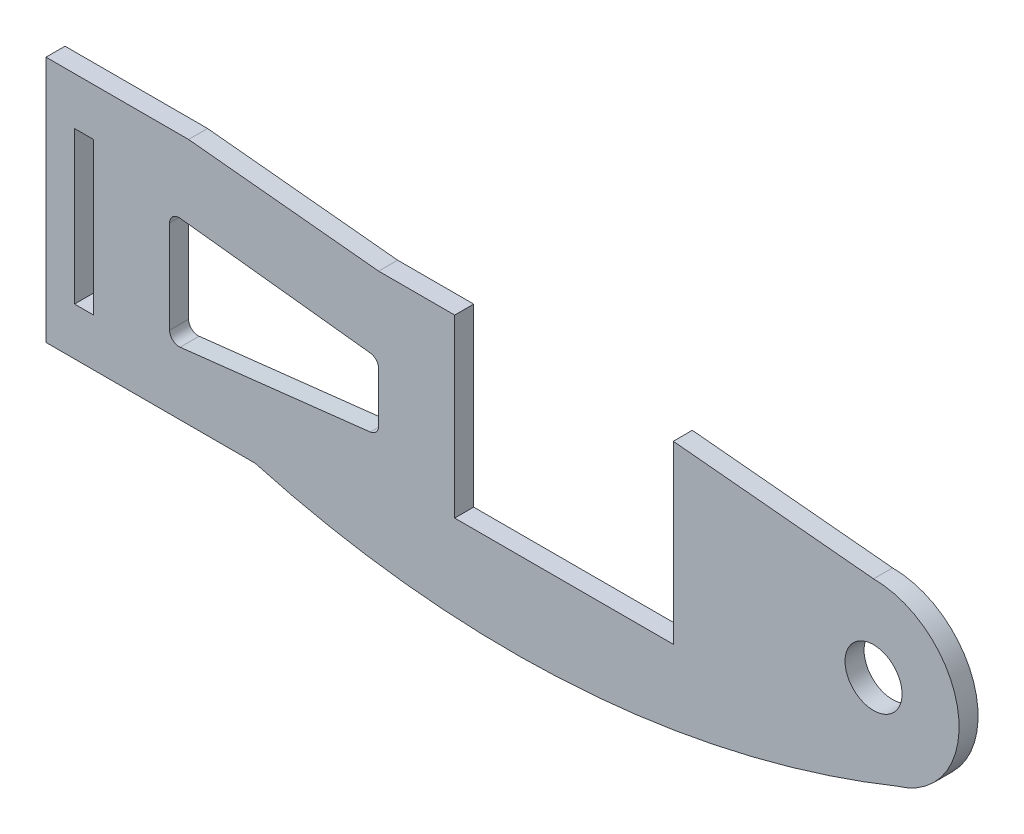
ISO-10303-21;
HEADER;
FILE_DESCRIPTION(('STEP AP214'),'2;1');
FILE_NAME('part.step','',(''),(''),'','','');
FILE_SCHEMA(('AUTOMOTIVE_DESIGN { 1 0 10303 214 1 1 1 1 }'));
ENDSEC;
DATA;
#1=APPLICATION_CONTEXT('core data for automotive mechanical design processes');
#2=APPLICATION_PROTOCOL_DEFINITION('international standard','automotive_design',2000,#1);
#3=PRODUCT_CONTEXT('',#1,'mechanical');
#4=PRODUCT('Part','Part','',(#3));
#5=PRODUCT_RELATED_PRODUCT_CATEGORY('part','',(#4));
#6=PRODUCT_DEFINITION_FORMATION('','',#4);
#7=PRODUCT_DEFINITION_CONTEXT('part definition',#1,'design');
#8=PRODUCT_DEFINITION('design','',#6,#7);
#9=PRODUCT_DEFINITION_SHAPE('','',#8);
#10=(LENGTH_UNIT() NAMED_UNIT(*) SI_UNIT(.MILLI.,.METRE.));
#11=(NAMED_UNIT(*) PLANE_ANGLE_UNIT() SI_UNIT($,.RADIAN.));
#12=(NAMED_UNIT(*) SI_UNIT($,.STERADIAN.) SOLID_ANGLE_UNIT());
#13=UNCERTAINTY_MEASURE_WITH_UNIT(LENGTH_MEASURE(1.E-05),#10,'distance_accuracy_value','');
#14=(GEOMETRIC_REPRESENTATION_CONTEXT(3) GLOBAL_UNCERTAINTY_ASSIGNED_CONTEXT((#13)) GLOBAL_UNIT_ASSIGNED_CONTEXT((#10,
#11,#12)) REPRESENTATION_CONTEXT('',''));
#15=CARTESIAN_POINT('',(0.,0.,0.));
#16=DIRECTION('',(0.,0.,1.));
#17=DIRECTION('',(1.,0.,0.));
#18=AXIS2_PLACEMENT_3D('',#15,#16,#17);
#19=CARTESIAN_POINT('',(0.,0.,2.));
#20=DIRECTION('',(0.,0.,1.));
#21=DIRECTION('',(1.,0.,0.));
#22=AXIS2_PLACEMENT_3D('',#19,#20,#21);
#23=PLANE('',#22);
#24=DIRECTION('',(-0.993605254789719,0.112909688044286,0.));
#25=VECTOR('',#24,1.);
#26=CARTESIAN_POINT('',(-72.9570903119557,5.37353298999495,2.));
#27=LINE('',#26,#25);
#28=CARTESIAN_POINT('',(-52.9570903119557,3.10080571726768,2.));
#29=VERTEX_POINT('',#28);
#30=CARTESIAN_POINT('',(-72.9570903119557,5.37353298999495,2.));
#31=VERTEX_POINT('',#30);
#32=EDGE_CURVE('E229',#29,#31,#27,.T.);
#33=ORIENTED_EDGE('',*,*,#32,.F.);
#34=CARTESIAN_POINT('',(-53.07,2.10720046247797,2.));
#35=DIRECTION('',(0.,0.,1.));
#36=DIRECTION('',(-1.,0.,0.));
#37=AXIS2_PLACEMENT_3D('',#34,#35,#36);
#38=CIRCLE('',#37,0.999999999999998);
#39=CARTESIAN_POINT('',(-52.07,2.10720046247797,2.));
#40=VERTEX_POINT('',#39);
#41=EDGE_CURVE('E227',#40,#29,#38,.T.);
#42=ORIENTED_EDGE('',*,*,#41,.F.);
#43=DIRECTION('',(0.,1.,0.));
#44=VECTOR('',#43,1.);
#45=CARTESIAN_POINT('',(-52.07,2.10720046247797,2.));
#46=LINE('',#45,#44);
#47=CARTESIAN_POINT('',(-52.07,-3.10720046247798,2.));
#48=VERTEX_POINT('',#47);
#49=EDGE_CURVE('E243',#48,#40,#46,.T.);
#50=ORIENTED_EDGE('',*,*,#49,.F.);
#51=CARTESIAN_POINT('',(-53.07,-3.10720046247798,2.));
#52=DIRECTION('',(0.,0.,1.));
#53=DIRECTION('',(-1.,0.,0.));
#54=AXIS2_PLACEMENT_3D('',#51,#52,#53);
#55=CIRCLE('',#54,1.);
#56=CARTESIAN_POINT('',(-52.9570903119557,-4.10080571726771,2.));
#57=VERTEX_POINT('',#56);
#58=EDGE_CURVE('E240',#57,#48,#55,.T.);
#59=ORIENTED_EDGE('',*,*,#58,.F.);
#60=DIRECTION('',(0.993605254789719,0.112909688044287,0.));
#61=VECTOR('',#60,1.);
#62=CARTESIAN_POINT('',(-52.9570903119557,-4.10080571726771,2.));
#63=LINE('',#62,#61);
#64=CARTESIAN_POINT('',(-72.9570903119557,-6.37353298999499,2.));
#65=VERTEX_POINT('',#64);
#66=EDGE_CURVE('E238',#65,#57,#63,.T.);
#67=ORIENTED_EDGE('',*,*,#66,.F.);
#68=CARTESIAN_POINT('',(-73.07,-5.37992773520527,2.));
#69=DIRECTION('',(0.,0.,1.));
#70=DIRECTION('',(1.,0.,0.));
#71=AXIS2_PLACEMENT_3D('',#68,#69,#70);
#72=CIRCLE('',#71,1.);
#73=CARTESIAN_POINT('',(-74.07,-5.37992773520527,2.));
#74=VERTEX_POINT('',#73);
#75=EDGE_CURVE('E236',#74,#65,#72,.T.);
#76=ORIENTED_EDGE('',*,*,#75,.F.);
#77=DIRECTION('',(0.,-1.,0.));
#78=VECTOR('',#77,1.);
#79=CARTESIAN_POINT('',(-74.07,-5.37992773520527,2.));
#80=LINE('',#79,#78);
#81=CARTESIAN_POINT('',(-74.07,4.37992773520523,2.));
#82=VERTEX_POINT('',#81);
#83=EDGE_CURVE('E234',#82,#74,#80,.T.);
#84=ORIENTED_EDGE('',*,*,#83,.F.);
#85=CARTESIAN_POINT('',(-73.07,4.37992773520523,2.));
#86=DIRECTION('',(0.,0.,1.));
#87=DIRECTION('',(1.,0.,0.));
#88=AXIS2_PLACEMENT_3D('',#85,#86,#87);
#89=CIRCLE('',#88,1.);
#90=EDGE_CURVE('E232',#31,#82,#89,.T.);
#91=ORIENTED_EDGE('',*,*,#90,.F.);
#92=EDGE_LOOP('',(#33,#42,#50,#59,#67,#76,#84,#91));
#93=FACE_BOUND('',#92,.T.);
#94=CARTESIAN_POINT('',(0.,0.,2.));
#95=DIRECTION('',(0.,0.,1.));
#96=DIRECTION('',(1.,0.,0.));
#97=AXIS2_PLACEMENT_3D('',#94,#95,#96);
#98=CIRCLE('',#97,9.);
#99=CARTESIAN_POINT('',(2.49677045181554,-8.64674142732052,2.));
#100=VERTEX_POINT('',#99);
#101=CARTESIAN_POINT('',(0.,9.,2.));
#102=VERTEX_POINT('',#101);
#103=EDGE_CURVE('E292',#100,#102,#98,.T.);
#104=ORIENTED_EDGE('',*,*,#103,.T.);
#105=DIRECTION('',(-0.995525153023159,0.0944969295703047,0.));
#106=VECTOR('',#105,1.);
#107=CARTESIAN_POINT('',(-21.07,11.,2.));
#108=LINE('',#107,#106);
#109=CARTESIAN_POINT('',(-21.07,11.,2.));
#110=VERTEX_POINT('',#109);
#111=EDGE_CURVE('E295',#102,#110,#108,.T.);
#112=ORIENTED_EDGE('',*,*,#111,.T.);
#113=DIRECTION('',(0.,-1.,0.));
#114=VECTOR('',#113,1.);
#115=CARTESIAN_POINT('',(-21.07,11.,2.));
#116=LINE('',#115,#114);
#117=CARTESIAN_POINT('',(-21.07,-7.5,2.));
#118=VERTEX_POINT('',#117);
#119=EDGE_CURVE('E298',#110,#118,#116,.T.);
#120=ORIENTED_EDGE('',*,*,#119,.T.);
#121=DIRECTION('',(-1.,0.,0.));
#122=VECTOR('',#121,1.);
#123=CARTESIAN_POINT('',(-21.07,-7.5,2.));
#124=LINE('',#123,#122);
#125=CARTESIAN_POINT('',(-44.07,-7.5,2.));
#126=VERTEX_POINT('',#125);
#127=EDGE_CURVE('E300',#118,#126,#124,.T.);
#128=ORIENTED_EDGE('',*,*,#127,.T.);
#129=DIRECTION('',(0.,1.,0.));
#130=VECTOR('',#129,1.);
#131=CARTESIAN_POINT('',(-44.07,-7.5,2.));
#132=LINE('',#131,#130);
#133=CARTESIAN_POINT('',(-44.07,11.,2.));
#134=VERTEX_POINT('',#133);
#135=EDGE_CURVE('E302',#126,#134,#132,.T.);
#136=ORIENTED_EDGE('',*,*,#135,.T.);
#137=DIRECTION('',(-1.,0.,0.));
#138=VECTOR('',#137,1.);
#139=CARTESIAN_POINT('',(-52.07,11.,2.));
#140=LINE('',#139,#138);
#141=CARTESIAN_POINT('',(-52.07,11.,2.));
#142=VERTEX_POINT('',#141);
#143=EDGE_CURVE('E304',#134,#142,#140,.T.);
#144=ORIENTED_EDGE('',*,*,#143,.T.);
#145=DIRECTION('',(-0.995037190209989,0.099503719020999,0.));
#146=VECTOR('',#145,1.);
#147=CARTESIAN_POINT('',(-72.07,13.,2.));
#148=LINE('',#147,#146);
#149=CARTESIAN_POINT('',(-72.07,13.,2.));
#150=VERTEX_POINT('',#149);
#151=EDGE_CURVE('E306',#142,#150,#148,.T.);
#152=ORIENTED_EDGE('',*,*,#151,.T.);
#153=DIRECTION('',(-1.,0.,0.));
#154=VECTOR('',#153,1.);
#155=CARTESIAN_POINT('',(-87.07,13.,2.));
#156=LINE('',#155,#154);
#157=CARTESIAN_POINT('',(-87.07,13.,2.));
#158=VERTEX_POINT('',#157);
#159=EDGE_CURVE('E308',#150,#158,#156,.T.);
#160=ORIENTED_EDGE('',*,*,#159,.T.);
#161=DIRECTION('',(0.,-1.,0.));
#162=VECTOR('',#161,1.);
#163=CARTESIAN_POINT('',(-87.07,13.,2.));
#164=LINE('',#163,#162);
#165=CARTESIAN_POINT('',(-87.07,-13.,2.));
#166=VERTEX_POINT('',#165);
#167=EDGE_CURVE('E310',#158,#166,#164,.T.);
#168=ORIENTED_EDGE('',*,*,#167,.T.);
#169=DIRECTION('',(1.,0.,0.));
#170=VECTOR('',#169,1.);
#171=CARTESIAN_POINT('',(-87.07,-13.,2.));
#172=LINE('',#171,#170);
#173=CARTESIAN_POINT('',(-65.07,-13.,2.));
#174=VERTEX_POINT('',#173);
#175=EDGE_CURVE('E312',#166,#174,#172,.T.);
#176=ORIENTED_EDGE('',*,*,#175,.T.);
#177=CARTESIAN_POINT('',(-65.07,-13.,2.));
#178=CARTESIAN_POINT('',(-43.2397886006025,-19.0935272248124,2.));
#179=CARTESIAN_POINT('',(-19.7501232626039,-17.6424410341031,2.));
#180=CARTESIAN_POINT('',(2.49677045181554,-8.64674142732052,2.));
#181=B_SPLINE_CURVE_WITH_KNOTS('',3,(#177,#178,#179,#180),.UNSPECIFIED.,.F.,.F.,(4,4),(0.,
0.972962773509415),.UNSPECIFIED.);
#182=EDGE_CURVE('E314',#174,#100,#181,.T.);
#183=ORIENTED_EDGE('',*,*,#182,.T.);
#184=EDGE_LOOP('',(#104,#112,#120,#128,#136,#144,#152,#160,#168,#176,#183));
#185=FACE_BOUND('',#184,.T.);
#186=CARTESIAN_POINT('',(0.,0.,2.));
#187=DIRECTION('',(0.,0.,1.));
#188=DIRECTION('',(1.,0.,0.));
#189=AXIS2_PLACEMENT_3D('',#186,#187,#188);
#190=CIRCLE('',#189,3.);
#191=CARTESIAN_POINT('',(3.,0.,2.));
#192=VERTEX_POINT('',#191);
#193=EDGE_CURVE('E286',#192,#192,#190,.T.);
#194=ORIENTED_EDGE('',*,*,#193,.F.);
#195=EDGE_LOOP('',(#194));
#196=FACE_BOUND('',#195,.T.);
#197=DIRECTION('',(-1.,0.,0.));
#198=VECTOR('',#197,1.);
#199=CARTESIAN_POINT('',(-84.07,8.,2.));
#200=LINE('',#199,#198);
#201=CARTESIAN_POINT('',(-82.07,8.,2.));
#202=VERTEX_POINT('',#201);
#203=CARTESIAN_POINT('',(-84.07,8.,2.));
#204=VERTEX_POINT('',#203);
#205=EDGE_CURVE('E199',#202,#204,#200,.T.);
#206=ORIENTED_EDGE('',*,*,#205,.F.);
#207=DIRECTION('',(0.,1.,0.));
#208=VECTOR('',#207,1.);
#209=CARTESIAN_POINT('',(-82.07,-8.,2.));
#210=LINE('',#209,#208);
#211=CARTESIAN_POINT('',(-82.07,-8.,2.));
#212=VERTEX_POINT('',#211);
#213=EDGE_CURVE('E191',#212,#202,#210,.T.);
#214=ORIENTED_EDGE('',*,*,#213,.F.);
#215=DIRECTION('',(1.,0.,0.));
#216=VECTOR('',#215,1.);
#217=CARTESIAN_POINT('',(-84.07,-8.,2.));
#218=LINE('',#217,#216);
#219=CARTESIAN_POINT('',(-84.07,-8.,2.));
#220=VERTEX_POINT('',#219);
#221=EDGE_CURVE('E213',#220,#212,#218,.T.);
#222=ORIENTED_EDGE('',*,*,#221,.F.);
#223=DIRECTION('',(0.,-1.,0.));
#224=VECTOR('',#223,1.);
#225=CARTESIAN_POINT('',(-84.07,-8.,2.));
#226=LINE('',#225,#224);
#227=EDGE_CURVE('E211',#204,#220,#226,.T.);
#228=ORIENTED_EDGE('',*,*,#227,.F.);
#229=EDGE_LOOP('',(#206,#214,#222,#228));
#230=FACE_BOUND('',#229,.T.);
#231=ADVANCED_FACE('F36',(#93,#185,#196,#230),#23,.T.);
#232=CARTESIAN_POINT('',(0.,0.,0.));
#233=DIRECTION('',(0.,0.,1.));
#234=DIRECTION('',(1.,0.,0.));
#235=AXIS2_PLACEMENT_3D('',#232,#233,#234);
#236=PLANE('',#235);
#237=CARTESIAN_POINT('',(-53.07,2.10720046247797,0.));
#238=DIRECTION('',(0.,0.,1.));
#239=DIRECTION('',(-1.,0.,0.));
#240=AXIS2_PLACEMENT_3D('',#237,#238,#239);
#241=CIRCLE('',#240,0.999999999999998);
#242=CARTESIAN_POINT('',(-52.07,2.10720046247797,0.));
#243=VERTEX_POINT('',#242);
#244=CARTESIAN_POINT('',(-52.9570903119557,3.10080571726768,0.));
#245=VERTEX_POINT('',#244);
#246=EDGE_CURVE('E207',#243,#245,#241,.T.);
#247=ORIENTED_EDGE('',*,*,#246,.T.);
#248=DIRECTION('',(-0.993605254789719,0.112909688044286,0.));
#249=VECTOR('',#248,1.);
#250=CARTESIAN_POINT('',(-72.9570903119557,5.37353298999495,0.));
#251=LINE('',#250,#249);
#252=CARTESIAN_POINT('',(-72.9570903119557,5.37353298999495,0.));
#253=VERTEX_POINT('',#252);
#254=EDGE_CURVE('E248',#245,#253,#251,.T.);
#255=ORIENTED_EDGE('',*,*,#254,.T.);
#256=CARTESIAN_POINT('',(-73.07,4.37992773520523,0.));
#257=DIRECTION('',(0.,0.,1.));
#258=DIRECTION('',(1.,0.,0.));
#259=AXIS2_PLACEMENT_3D('',#256,#257,#258);
#260=CIRCLE('',#259,1.);
#261=CARTESIAN_POINT('',(-74.07,4.37992773520523,0.));
#262=VERTEX_POINT('',#261);
#263=EDGE_CURVE('E251',#253,#262,#260,.T.);
#264=ORIENTED_EDGE('',*,*,#263,.T.);
#265=DIRECTION('',(0.,-1.,0.));
#266=VECTOR('',#265,1.);
#267=CARTESIAN_POINT('',(-74.07,-5.37992773520527,0.));
#268=LINE('',#267,#266);
#269=CARTESIAN_POINT('',(-74.07,-5.37992773520527,0.));
#270=VERTEX_POINT('',#269);
#271=EDGE_CURVE('E254',#262,#270,#268,.T.);
#272=ORIENTED_EDGE('',*,*,#271,.T.);
#273=CARTESIAN_POINT('',(-73.07,-5.37992773520527,0.));
#274=DIRECTION('',(0.,0.,1.));
#275=DIRECTION('',(1.,0.,0.));
#276=AXIS2_PLACEMENT_3D('',#273,#274,#275);
#277=CIRCLE('',#276,1.);
#278=CARTESIAN_POINT('',(-72.9570903119557,-6.37353298999499,0.));
#279=VERTEX_POINT('',#278);
#280=EDGE_CURVE('E257',#270,#279,#277,.T.);
#281=ORIENTED_EDGE('',*,*,#280,.T.);
#282=DIRECTION('',(0.993605254789719,0.112909688044287,0.));
#283=VECTOR('',#282,1.);
#284=CARTESIAN_POINT('',(-52.9570903119557,-4.10080571726771,0.));
#285=LINE('',#284,#283);
#286=CARTESIAN_POINT('',(-52.9570903119557,-4.10080571726771,0.));
#287=VERTEX_POINT('',#286);
#288=EDGE_CURVE('E260',#279,#287,#285,.T.);
#289=ORIENTED_EDGE('',*,*,#288,.T.);
#290=CARTESIAN_POINT('',(-53.07,-3.10720046247798,0.));
#291=DIRECTION('',(0.,0.,1.));
#292=DIRECTION('',(-1.,0.,0.));
#293=AXIS2_PLACEMENT_3D('',#290,#291,#292);
#294=CIRCLE('',#293,1.);
#295=CARTESIAN_POINT('',(-52.07,-3.10720046247798,0.));
#296=VERTEX_POINT('',#295);
#297=EDGE_CURVE('E263',#287,#296,#294,.T.);
#298=ORIENTED_EDGE('',*,*,#297,.T.);
#299=DIRECTION('',(0.,1.,0.));
#300=VECTOR('',#299,1.);
#301=CARTESIAN_POINT('',(-52.07,2.10720046247797,0.));
#302=LINE('',#301,#300);
#303=EDGE_CURVE('E230',#296,#243,#302,.T.);
#304=ORIENTED_EDGE('',*,*,#303,.T.);
#305=EDGE_LOOP('',(#247,#255,#264,#272,#281,#289,#298,#304));
#306=FACE_BOUND('',#305,.T.);
#307=CARTESIAN_POINT('',(0.,0.,0.));
#308=DIRECTION('',(0.,0.,1.));
#309=DIRECTION('',(1.,0.,0.));
#310=AXIS2_PLACEMENT_3D('',#307,#308,#309);
#311=CIRCLE('',#310,9.);
#312=CARTESIAN_POINT('',(2.49677045181554,-8.64674142732052,0.));
#313=VERTEX_POINT('',#312);
#314=CARTESIAN_POINT('',(0.,9.,0.));
#315=VERTEX_POINT('',#314);
#316=EDGE_CURVE('E289',#313,#315,#311,.T.);
#317=ORIENTED_EDGE('',*,*,#316,.F.);
#318=CARTESIAN_POINT('',(-65.07,-13.,0.));
#319=CARTESIAN_POINT('',(-43.2397886006025,-19.0935272248124,0.));
#320=CARTESIAN_POINT('',(-19.7501232626039,-17.6424410341031,0.));
#321=CARTESIAN_POINT('',(2.49677045181554,-8.64674142732052,0.));
#322=B_SPLINE_CURVE_WITH_KNOTS('',3,(#318,#319,#320,#321),.UNSPECIFIED.,.F.,.F.,(4,4),(0.,
0.972962773509415),.UNSPECIFIED.);
#323=CARTESIAN_POINT('',(-65.07,-13.,0.));
#324=VERTEX_POINT('',#323);
#325=EDGE_CURVE('E296',#324,#313,#322,.T.);
#326=ORIENTED_EDGE('',*,*,#325,.F.);
#327=DIRECTION('',(1.,0.,0.));
#328=VECTOR('',#327,1.);
#329=CARTESIAN_POINT('',(-87.07,-13.,0.));
#330=LINE('',#329,#328);
#331=CARTESIAN_POINT('',(-87.07,-13.,0.));
#332=VERTEX_POINT('',#331);
#333=EDGE_CURVE('E628',#332,#324,#330,.T.);
#334=ORIENTED_EDGE('',*,*,#333,.F.);
#335=DIRECTION('',(0.,-1.,0.));
#336=VECTOR('',#335,1.);
#337=CARTESIAN_POINT('',(-87.07,13.,0.));
#338=LINE('',#337,#336);
#339=CARTESIAN_POINT('',(-87.07,13.,0.));
#340=VERTEX_POINT('',#339);
#341=EDGE_CURVE('E626',#340,#332,#338,.T.);
#342=ORIENTED_EDGE('',*,*,#341,.F.);
#343=DIRECTION('',(-1.,0.,0.));
#344=VECTOR('',#343,1.);
#345=CARTESIAN_POINT('',(-87.07,13.,0.));
#346=LINE('',#345,#344);
#347=CARTESIAN_POINT('',(-72.07,13.,0.));
#348=VERTEX_POINT('',#347);
#349=EDGE_CURVE('E624',#348,#340,#346,.T.);
#350=ORIENTED_EDGE('',*,*,#349,.F.);
#351=DIRECTION('',(-0.995037190209989,0.099503719020999,0.));
#352=VECTOR('',#351,1.);
#353=CARTESIAN_POINT('',(-72.07,13.,0.));
#354=LINE('',#353,#352);
#355=CARTESIAN_POINT('',(-52.07,11.,0.));
#356=VERTEX_POINT('',#355);
#357=EDGE_CURVE('E622',#356,#348,#354,.T.);
#358=ORIENTED_EDGE('',*,*,#357,.F.);
#359=DIRECTION('',(-1.,0.,0.));
#360=VECTOR('',#359,1.);
#361=CARTESIAN_POINT('',(-52.07,11.,0.));
#362=LINE('',#361,#360);
#363=CARTESIAN_POINT('',(-44.07,11.,0.));
#364=VERTEX_POINT('',#363);
#365=EDGE_CURVE('E620',#364,#356,#362,.T.);
#366=ORIENTED_EDGE('',*,*,#365,.F.);
#367=DIRECTION('',(0.,1.,0.));
#368=VECTOR('',#367,1.);
#369=CARTESIAN_POINT('',(-44.07,-7.5,0.));
#370=LINE('',#369,#368);
#371=CARTESIAN_POINT('',(-44.07,-7.5,0.));
#372=VERTEX_POINT('',#371);
#373=EDGE_CURVE('E618',#372,#364,#370,.T.);
#374=ORIENTED_EDGE('',*,*,#373,.F.);
#375=DIRECTION('',(-1.,0.,0.));
#376=VECTOR('',#375,1.);
#377=CARTESIAN_POINT('',(-21.07,-7.5,0.));
#378=LINE('',#377,#376);
#379=CARTESIAN_POINT('',(-21.07,-7.5,0.));
#380=VERTEX_POINT('',#379);
#381=EDGE_CURVE('E614',#380,#372,#378,.T.);
#382=ORIENTED_EDGE('',*,*,#381,.F.);
#383=DIRECTION('',(0.,-1.,0.));
#384=VECTOR('',#383,1.);
#385=CARTESIAN_POINT('',(-21.07,11.,0.));
#386=LINE('',#385,#384);
#387=CARTESIAN_POINT('',(-21.07,11.,0.));
#388=VERTEX_POINT('',#387);
#389=EDGE_CURVE('E611',#388,#380,#386,.T.);
#390=ORIENTED_EDGE('',*,*,#389,.F.);
#391=DIRECTION('',(-0.995525153023159,0.0944969295703047,0.));
#392=VECTOR('',#391,1.);
#393=CARTESIAN_POINT('',(-21.07,11.,0.));
#394=LINE('',#393,#392);
#395=EDGE_CURVE('E608',#315,#388,#394,.T.);
#396=ORIENTED_EDGE('',*,*,#395,.F.);
#397=EDGE_LOOP('',(#317,#326,#334,#342,#350,#358,#366,#374,#382,#390,#396));
#398=FACE_BOUND('',#397,.T.);
#399=CARTESIAN_POINT('',(0.,0.,0.));
#400=DIRECTION('',(0.,0.,1.));
#401=DIRECTION('',(1.,0.,0.));
#402=AXIS2_PLACEMENT_3D('',#399,#400,#401);
#403=CIRCLE('',#402,3.);
#404=CARTESIAN_POINT('',(3.,0.,0.));
#405=VERTEX_POINT('',#404);
#406=EDGE_CURVE('E285',#405,#405,#403,.T.);
#407=ORIENTED_EDGE('',*,*,#406,.T.);
#408=EDGE_LOOP('',(#407));
#409=FACE_BOUND('',#408,.T.);
#410=DIRECTION('',(0.,1.,0.));
#411=VECTOR('',#410,1.);
#412=CARTESIAN_POINT('',(-82.07,-8.,0.));
#413=LINE('',#412,#411);
#414=CARTESIAN_POINT('',(-82.07,-8.,0.));
#415=VERTEX_POINT('',#414);
#416=CARTESIAN_POINT('',(-82.07,8.,0.));
#417=VERTEX_POINT('',#416);
#418=EDGE_CURVE('E59',#415,#417,#413,.T.);
#419=ORIENTED_EDGE('',*,*,#418,.T.);
#420=DIRECTION('',(-1.,0.,0.));
#421=VECTOR('',#420,1.);
#422=CARTESIAN_POINT('',(-84.07,8.,0.));
#423=LINE('',#422,#421);
#424=CARTESIAN_POINT('',(-84.07,8.,0.));
#425=VERTEX_POINT('',#424);
#426=EDGE_CURVE('E206',#417,#425,#423,.T.);
#427=ORIENTED_EDGE('',*,*,#426,.T.);
#428=DIRECTION('',(0.,-1.,0.));
#429=VECTOR('',#428,1.);
#430=CARTESIAN_POINT('',(-84.07,-8.,0.));
#431=LINE('',#430,#429);
#432=CARTESIAN_POINT('',(-84.07,-8.,0.));
#433=VERTEX_POINT('',#432);
#434=EDGE_CURVE('E219',#425,#433,#431,.T.);
#435=ORIENTED_EDGE('',*,*,#434,.T.);
#436=DIRECTION('',(1.,0.,0.));
#437=VECTOR('',#436,1.);
#438=CARTESIAN_POINT('',(-84.07,-8.,0.));
#439=LINE('',#438,#437);
#440=EDGE_CURVE('E200',#433,#415,#439,.T.);
#441=ORIENTED_EDGE('',*,*,#440,.T.);
#442=EDGE_LOOP('',(#419,#427,#435,#441));
#443=FACE_BOUND('',#442,.T.);
#444=ADVANCED_FACE('F332',(#306,#398,#409,#443),#236,.F.);
#445=CARTESIAN_POINT('',(0.,0.,2.));
#446=DIRECTION('',(0.,0.,-1.));
#447=DIRECTION('',(-1.,0.,0.));
#448=AXIS2_PLACEMENT_3D('',#445,#446,#447);
#449=CYLINDRICAL_SURFACE('',#448,9.);
#450=ORIENTED_EDGE('',*,*,#316,.T.);
#451=DIRECTION('',(0.,0.,-1.));
#452=VECTOR('',#451,1.);
#453=CARTESIAN_POINT('',(0.,9.,2.));
#454=LINE('',#453,#452);
#455=EDGE_CURVE('E11',#102,#315,#454,.T.);
#456=ORIENTED_EDGE('',*,*,#455,.F.);
#457=ORIENTED_EDGE('',*,*,#103,.F.);
#458=DIRECTION('',(0.,0.,-1.));
#459=VECTOR('',#458,1.);
#460=CARTESIAN_POINT('',(2.49677045181554,-8.64674142732052,2.));
#461=LINE('',#460,#459);
#462=EDGE_CURVE('E319',#100,#313,#461,.T.);
#463=ORIENTED_EDGE('',*,*,#462,.T.);
#464=EDGE_LOOP('',(#450,#456,#457,#463));
#465=FACE_BOUND('',#464,.T.);
#466=ADVANCED_FACE('F38',(#465),#449,.T.);
#467=CARTESIAN_POINT('',(-21.07,11.,2.));
#468=DIRECTION('',(-0.0944969295703047,-0.995525153023159,0.));
#469=DIRECTION('',(0.99552515302316,-0.0944969295703047,0.));
#470=AXIS2_PLACEMENT_3D('',#467,#468,#469);
#471=PLANE('',#470);
#472=ORIENTED_EDGE('',*,*,#395,.T.);
#473=DIRECTION('',(0.,0.,-1.));
#474=VECTOR('',#473,1.);
#475=CARTESIAN_POINT('',(-21.07,11.,2.));
#476=LINE('',#475,#474);
#477=EDGE_CURVE('E44',#110,#388,#476,.T.);
#478=ORIENTED_EDGE('',*,*,#477,.F.);
#479=ORIENTED_EDGE('',*,*,#111,.F.);
#480=ORIENTED_EDGE('',*,*,#455,.T.);
#481=EDGE_LOOP('',(#472,#478,#479,#480));
#482=FACE_BOUND('',#481,.T.);
#483=ADVANCED_FACE('F363',(#482),#471,.F.);
#484=CARTESIAN_POINT('',(-21.07,11.,2.));
#485=DIRECTION('',(1.,0.,0.));
#486=DIRECTION('',(0.,0.,-1.));
#487=AXIS2_PLACEMENT_3D('',#484,#485,#486);
#488=PLANE('',#487);
#489=ORIENTED_EDGE('',*,*,#389,.T.);
#490=DIRECTION('',(0.,0.,-1.));
#491=VECTOR('',#490,1.);
#492=CARTESIAN_POINT('',(-21.07,-7.5,2.));
#493=LINE('',#492,#491);
#494=EDGE_CURVE('E658',#118,#380,#493,.T.);
#495=ORIENTED_EDGE('',*,*,#494,.F.);
#496=ORIENTED_EDGE('',*,*,#119,.F.);
#497=ORIENTED_EDGE('',*,*,#477,.T.);
#498=EDGE_LOOP('',(#489,#495,#496,#497));
#499=FACE_BOUND('',#498,.T.);
#500=ADVANCED_FACE('F360',(#499),#488,.F.);
#501=CARTESIAN_POINT('',(-21.07,-7.5,2.));
#502=DIRECTION('',(0.,-1.,0.));
#503=DIRECTION('',(1.,0.,0.));
#504=AXIS2_PLACEMENT_3D('',#501,#502,#503);
#505=PLANE('',#504);
#506=ORIENTED_EDGE('',*,*,#381,.T.);
#507=DIRECTION('',(0.,0.,-1.));
#508=VECTOR('',#507,1.);
#509=CARTESIAN_POINT('',(-44.07,-7.5,2.));
#510=LINE('',#509,#508);
#511=EDGE_CURVE('E655',#126,#372,#510,.T.);
#512=ORIENTED_EDGE('',*,*,#511,.F.);
#513=ORIENTED_EDGE('',*,*,#127,.F.);
#514=ORIENTED_EDGE('',*,*,#494,.T.);
#515=EDGE_LOOP('',(#506,#512,#513,#514));
#516=FACE_BOUND('',#515,.T.);
#517=ADVANCED_FACE('F356',(#516),#505,.F.);
#518=CARTESIAN_POINT('',(-44.07,-7.5,2.));
#519=DIRECTION('',(-1.,0.,0.));
#520=DIRECTION('',(0.,0.,1.));
#521=AXIS2_PLACEMENT_3D('',#518,#519,#520);
#522=PLANE('',#521);
#523=ORIENTED_EDGE('',*,*,#373,.T.);
#524=DIRECTION('',(0.,0.,-1.));
#525=VECTOR('',#524,1.);
#526=CARTESIAN_POINT('',(-44.07,11.,2.));
#527=LINE('',#526,#525);
#528=EDGE_CURVE('E652',#134,#364,#527,.T.);
#529=ORIENTED_EDGE('',*,*,#528,.F.);
#530=ORIENTED_EDGE('',*,*,#135,.F.);
#531=ORIENTED_EDGE('',*,*,#511,.T.);
#532=EDGE_LOOP('',(#523,#529,#530,#531));
#533=FACE_BOUND('',#532,.T.);
#534=ADVANCED_FACE('F352',(#533),#522,.F.);
#535=CARTESIAN_POINT('',(-52.07,11.,2.));
#536=DIRECTION('',(0.,-1.,0.));
#537=DIRECTION('',(0.,0.,-1.));
#538=AXIS2_PLACEMENT_3D('',#535,#536,#537);
#539=PLANE('',#538);
#540=ORIENTED_EDGE('',*,*,#365,.T.);
#541=DIRECTION('',(0.,0.,-1.));
#542=VECTOR('',#541,1.);
#543=CARTESIAN_POINT('',(-52.07,11.,2.));
#544=LINE('',#543,#542);
#545=EDGE_CURVE('E649',#142,#356,#544,.T.);
#546=ORIENTED_EDGE('',*,*,#545,.F.);
#547=ORIENTED_EDGE('',*,*,#143,.F.);
#548=ORIENTED_EDGE('',*,*,#528,.T.);
#549=EDGE_LOOP('',(#540,#546,#547,#548));
#550=FACE_BOUND('',#549,.T.);
#551=ADVANCED_FACE('F348',(#550),#539,.F.);
#552=CARTESIAN_POINT('',(-72.07,13.,2.));
#553=DIRECTION('',(-0.099503719020999,-0.995037190209989,0.));
#554=DIRECTION('',(0.995037190209989,-0.099503719020999,0.));
#555=AXIS2_PLACEMENT_3D('',#552,#553,#554);
#556=PLANE('',#555);
#557=ORIENTED_EDGE('',*,*,#357,.T.);
#558=DIRECTION('',(0.,0.,-1.));
#559=VECTOR('',#558,1.);
#560=CARTESIAN_POINT('',(-72.07,13.,2.));
#561=LINE('',#560,#559);
#562=EDGE_CURVE('E646',#150,#348,#561,.T.);
#563=ORIENTED_EDGE('',*,*,#562,.F.);
#564=ORIENTED_EDGE('',*,*,#151,.F.);
#565=ORIENTED_EDGE('',*,*,#545,.T.);
#566=EDGE_LOOP('',(#557,#563,#564,#565));
#567=FACE_BOUND('',#566,.T.);
#568=ADVANCED_FACE('F344',(#567),#556,.F.);
#569=CARTESIAN_POINT('',(-87.07,13.,2.));
#570=DIRECTION('',(0.,-1.,0.));
#571=DIRECTION('',(1.,0.,0.));
#572=AXIS2_PLACEMENT_3D('',#569,#570,#571);
#573=PLANE('',#572);
#574=ORIENTED_EDGE('',*,*,#349,.T.);
#575=DIRECTION('',(0.,0.,-1.));
#576=VECTOR('',#575,1.);
#577=CARTESIAN_POINT('',(-87.07,13.,2.));
#578=LINE('',#577,#576);
#579=EDGE_CURVE('E643',#158,#340,#578,.T.);
#580=ORIENTED_EDGE('',*,*,#579,.F.);
#581=ORIENTED_EDGE('',*,*,#159,.F.);
#582=ORIENTED_EDGE('',*,*,#562,.T.);
#583=EDGE_LOOP('',(#574,#580,#581,#582));
#584=FACE_BOUND('',#583,.T.);
#585=ADVANCED_FACE('F340',(#584),#573,.F.);
#586=CARTESIAN_POINT('',(-87.07,13.,2.));
#587=DIRECTION('',(1.,0.,0.));
#588=DIRECTION('',(0.,0.,-1.));
#589=AXIS2_PLACEMENT_3D('',#586,#587,#588);
#590=PLANE('',#589);
#591=ORIENTED_EDGE('',*,*,#341,.T.);
#592=DIRECTION('',(0.,0.,-1.));
#593=VECTOR('',#592,1.);
#594=CARTESIAN_POINT('',(-87.07,-13.,2.));
#595=LINE('',#594,#593);
#596=EDGE_CURVE('E640',#166,#332,#595,.T.);
#597=ORIENTED_EDGE('',*,*,#596,.F.);
#598=ORIENTED_EDGE('',*,*,#167,.F.);
#599=ORIENTED_EDGE('',*,*,#579,.T.);
#600=EDGE_LOOP('',(#591,#597,#598,#599));
#601=FACE_BOUND('',#600,.T.);
#602=ADVANCED_FACE('F336',(#601),#590,.F.);
#603=CARTESIAN_POINT('',(-87.07,-13.,2.));
#604=DIRECTION('',(0.,1.,0.));
#605=DIRECTION('',(0.,0.,1.));
#606=AXIS2_PLACEMENT_3D('',#603,#604,#605);
#607=PLANE('',#606);
#608=ORIENTED_EDGE('',*,*,#333,.T.);
#609=DIRECTION('',(0.,0.,-1.));
#610=VECTOR('',#609,1.);
#611=CARTESIAN_POINT('',(-65.07,-13.,2.));
#612=LINE('',#611,#610);
#613=EDGE_CURVE('E637',#174,#324,#612,.T.);
#614=ORIENTED_EDGE('',*,*,#613,.F.);
#615=ORIENTED_EDGE('',*,*,#175,.F.);
#616=ORIENTED_EDGE('',*,*,#596,.T.);
#617=EDGE_LOOP('',(#608,#614,#615,#616));
#618=FACE_BOUND('',#617,.T.);
#619=ADVANCED_FACE('F330',(#618),#607,.F.);
#620=DIRECTION('',(0.,0.,-1.));
#621=VECTOR('',#620,1.);
#622=SURFACE_OF_LINEAR_EXTRUSION('',#181,#621);
#623=ORIENTED_EDGE('',*,*,#325,.T.);
#624=ORIENTED_EDGE('',*,*,#462,.F.);
#625=ORIENTED_EDGE('',*,*,#182,.F.);
#626=ORIENTED_EDGE('',*,*,#613,.T.);
#627=EDGE_LOOP('',(#623,#624,#625,#626));
#628=FACE_BOUND('',#627,.T.);
#629=ADVANCED_FACE('F325',(#628),#622,.F.);
#630=CARTESIAN_POINT('',(0.,0.,2.));
#631=DIRECTION('',(0.,0.,-1.));
#632=DIRECTION('',(-1.,0.,0.));
#633=AXIS2_PLACEMENT_3D('',#630,#631,#632);
#634=CYLINDRICAL_SURFACE('',#633,3.);
#635=ORIENTED_EDGE('',*,*,#193,.T.);
#636=EDGE_LOOP('',(#635));
#637=FACE_BOUND('',#636,.T.);
#638=ORIENTED_EDGE('',*,*,#406,.F.);
#639=EDGE_LOOP('',(#638));
#640=FACE_BOUND('',#639,.T.);
#641=ADVANCED_FACE('F329',(#637,#640),#634,.F.);
#642=CARTESIAN_POINT('',(-53.07,2.10720046247797,2.));
#643=DIRECTION('',(0.,0.,-1.));
#644=DIRECTION('',(-1.,0.,0.));
#645=AXIS2_PLACEMENT_3D('',#642,#643,#644);
#646=CYLINDRICAL_SURFACE('',#645,0.999999999999998);
#647=ORIENTED_EDGE('',*,*,#246,.F.);
#648=DIRECTION('',(0.,0.,-1.));
#649=VECTOR('',#648,1.);
#650=CARTESIAN_POINT('',(-52.07,2.10720046247797,2.));
#651=LINE('',#650,#649);
#652=EDGE_CURVE('E245',#40,#243,#651,.T.);
#653=ORIENTED_EDGE('',*,*,#652,.F.);
#654=ORIENTED_EDGE('',*,*,#41,.T.);
#655=DIRECTION('',(0.,0.,-1.));
#656=VECTOR('',#655,1.);
#657=CARTESIAN_POINT('',(-52.9570903119557,3.10080571726768,2.));
#658=LINE('',#657,#656);
#659=EDGE_CURVE('E282',#29,#245,#658,.T.);
#660=ORIENTED_EDGE('',*,*,#659,.T.);
#661=EDGE_LOOP('',(#647,#653,#654,#660));
#662=FACE_BOUND('',#661,.T.);
#663=ADVANCED_FACE('F382',(#662),#646,.F.);
#664=CARTESIAN_POINT('',(-72.9570903119557,5.37353298999495,2.));
#665=DIRECTION('',(-0.112909688044286,-0.993605254789719,0.));
#666=DIRECTION('',(0.993605254789719,-0.112909688044286,0.));
#667=AXIS2_PLACEMENT_3D('',#664,#665,#666);
#668=PLANE('',#667);
#669=ORIENTED_EDGE('',*,*,#254,.F.);
#670=ORIENTED_EDGE('',*,*,#659,.F.);
#671=ORIENTED_EDGE('',*,*,#32,.T.);
#672=DIRECTION('',(0.,0.,-1.));
#673=VECTOR('',#672,1.);
#674=CARTESIAN_POINT('',(-72.9570903119557,5.37353298999495,2.));
#675=LINE('',#674,#673);
#676=EDGE_CURVE('E280',#31,#253,#675,.T.);
#677=ORIENTED_EDGE('',*,*,#676,.T.);
#678=EDGE_LOOP('',(#669,#670,#671,#677));
#679=FACE_BOUND('',#678,.T.);
#680=ADVANCED_FACE('F386',(#679),#668,.T.);
#681=CARTESIAN_POINT('',(-73.07,4.37992773520523,2.));
#682=DIRECTION('',(0.,0.,-1.));
#683=DIRECTION('',(-1.,0.,0.));
#684=AXIS2_PLACEMENT_3D('',#681,#682,#683);
#685=CYLINDRICAL_SURFACE('',#684,1.);
#686=ORIENTED_EDGE('',*,*,#263,.F.);
#687=ORIENTED_EDGE('',*,*,#676,.F.);
#688=ORIENTED_EDGE('',*,*,#90,.T.);
#689=DIRECTION('',(0.,0.,-1.));
#690=VECTOR('',#689,1.);
#691=CARTESIAN_POINT('',(-74.07,4.37992773520523,2.));
#692=LINE('',#691,#690);
#693=EDGE_CURVE('E278',#82,#262,#692,.T.);
#694=ORIENTED_EDGE('',*,*,#693,.T.);
#695=EDGE_LOOP('',(#686,#687,#688,#694));
#696=FACE_BOUND('',#695,.T.);
#697=ADVANCED_FACE('F390',(#696),#685,.F.);
#698=CARTESIAN_POINT('',(-74.07,-5.37992773520527,2.));
#699=DIRECTION('',(1.,0.,0.));
#700=DIRECTION('',(0.,0.,-1.));
#701=AXIS2_PLACEMENT_3D('',#698,#699,#700);
#702=PLANE('',#701);
#703=ORIENTED_EDGE('',*,*,#271,.F.);
#704=ORIENTED_EDGE('',*,*,#693,.F.);
#705=ORIENTED_EDGE('',*,*,#83,.T.);
#706=DIRECTION('',(0.,0.,-1.));
#707=VECTOR('',#706,1.);
#708=CARTESIAN_POINT('',(-74.07,-5.37992773520527,2.));
#709=LINE('',#708,#707);
#710=EDGE_CURVE('E276',#74,#270,#709,.T.);
#711=ORIENTED_EDGE('',*,*,#710,.T.);
#712=EDGE_LOOP('',(#703,#704,#705,#711));
#713=FACE_BOUND('',#712,.T.);
#714=ADVANCED_FACE('F394',(#713),#702,.T.);
#715=CARTESIAN_POINT('',(-73.07,-5.37992773520527,2.));
#716=DIRECTION('',(0.,0.,-1.));
#717=DIRECTION('',(-1.,0.,0.));
#718=AXIS2_PLACEMENT_3D('',#715,#716,#717);
#719=CYLINDRICAL_SURFACE('',#718,1.);
#720=ORIENTED_EDGE('',*,*,#280,.F.);
#721=ORIENTED_EDGE('',*,*,#710,.F.);
#722=ORIENTED_EDGE('',*,*,#75,.T.);
#723=DIRECTION('',(0.,0.,-1.));
#724=VECTOR('',#723,1.);
#725=CARTESIAN_POINT('',(-72.9570903119557,-6.37353298999499,2.));
#726=LINE('',#725,#724);
#727=EDGE_CURVE('E274',#65,#279,#726,.T.);
#728=ORIENTED_EDGE('',*,*,#727,.T.);
#729=EDGE_LOOP('',(#720,#721,#722,#728));
#730=FACE_BOUND('',#729,.T.);
#731=ADVANCED_FACE('F398',(#730),#719,.F.);
#732=CARTESIAN_POINT('',(-52.9570903119557,-4.10080571726771,2.));
#733=DIRECTION('',(-0.112909688044287,0.993605254789719,0.));
#734=DIRECTION('',(-0.993605254789719,-0.112909688044287,0.));
#735=AXIS2_PLACEMENT_3D('',#732,#733,#734);
#736=PLANE('',#735);
#737=ORIENTED_EDGE('',*,*,#288,.F.);
#738=ORIENTED_EDGE('',*,*,#727,.F.);
#739=ORIENTED_EDGE('',*,*,#66,.T.);
#740=DIRECTION('',(0.,0.,-1.));
#741=VECTOR('',#740,1.);
#742=CARTESIAN_POINT('',(-52.9570903119557,-4.10080571726771,2.));
#743=LINE('',#742,#741);
#744=EDGE_CURVE('E272',#57,#287,#743,.T.);
#745=ORIENTED_EDGE('',*,*,#744,.T.);
#746=EDGE_LOOP('',(#737,#738,#739,#745));
#747=FACE_BOUND('',#746,.T.);
#748=ADVANCED_FACE('F402',(#747),#736,.T.);
#749=CARTESIAN_POINT('',(-53.07,-3.10720046247798,2.));
#750=DIRECTION('',(0.,0.,-1.));
#751=DIRECTION('',(-1.,0.,0.));
#752=AXIS2_PLACEMENT_3D('',#749,#750,#751);
#753=CYLINDRICAL_SURFACE('',#752,1.);
#754=ORIENTED_EDGE('',*,*,#297,.F.);
#755=ORIENTED_EDGE('',*,*,#744,.F.);
#756=ORIENTED_EDGE('',*,*,#58,.T.);
#757=DIRECTION('',(0.,0.,-1.));
#758=VECTOR('',#757,1.);
#759=CARTESIAN_POINT('',(-52.07,-3.10720046247798,2.));
#760=LINE('',#759,#758);
#761=EDGE_CURVE('E270',#48,#296,#760,.T.);
#762=ORIENTED_EDGE('',*,*,#761,.T.);
#763=EDGE_LOOP('',(#754,#755,#756,#762));
#764=FACE_BOUND('',#763,.T.);
#765=ADVANCED_FACE('F406',(#764),#753,.F.);
#766=CARTESIAN_POINT('',(-52.07,2.10720046247797,2.));
#767=DIRECTION('',(-1.,0.,0.));
#768=DIRECTION('',(0.,0.,1.));
#769=AXIS2_PLACEMENT_3D('',#766,#767,#768);
#770=PLANE('',#769);
#771=ORIENTED_EDGE('',*,*,#303,.F.);
#772=ORIENTED_EDGE('',*,*,#761,.F.);
#773=ORIENTED_EDGE('',*,*,#49,.T.);
#774=ORIENTED_EDGE('',*,*,#652,.T.);
#775=EDGE_LOOP('',(#771,#772,#773,#774));
#776=FACE_BOUND('',#775,.T.);
#777=ADVANCED_FACE('F410',(#776),#770,.T.);
#778=CARTESIAN_POINT('',(-82.07,-8.,2.));
#779=DIRECTION('',(-1.,0.,0.));
#780=DIRECTION('',(0.,0.,1.));
#781=AXIS2_PLACEMENT_3D('',#778,#779,#780);
#782=PLANE('',#781);
#783=ORIENTED_EDGE('',*,*,#418,.F.);
#784=DIRECTION('',(0.,0.,-1.));
#785=VECTOR('',#784,1.);
#786=CARTESIAN_POINT('',(-82.07,-8.,2.));
#787=LINE('',#786,#785);
#788=EDGE_CURVE('E195',#212,#415,#787,.T.);
#789=ORIENTED_EDGE('',*,*,#788,.F.);
#790=ORIENTED_EDGE('',*,*,#213,.T.);
#791=DIRECTION('',(0.,0.,-1.));
#792=VECTOR('',#791,1.);
#793=CARTESIAN_POINT('',(-82.07,8.,2.));
#794=LINE('',#793,#792);
#795=EDGE_CURVE('E194',#202,#417,#794,.T.);
#796=ORIENTED_EDGE('',*,*,#795,.T.);
#797=EDGE_LOOP('',(#783,#789,#790,#796));
#798=FACE_BOUND('',#797,.T.);
#799=ADVANCED_FACE('F193',(#798),#782,.T.);
#800=CARTESIAN_POINT('',(-84.07,8.,2.));
#801=DIRECTION('',(0.,-1.,0.));
#802=DIRECTION('',(0.,0.,-1.));
#803=AXIS2_PLACEMENT_3D('',#800,#801,#802);
#804=PLANE('',#803);
#805=ORIENTED_EDGE('',*,*,#426,.F.);
#806=ORIENTED_EDGE('',*,*,#795,.F.);
#807=ORIENTED_EDGE('',*,*,#205,.T.);
#808=DIRECTION('',(0.,0.,-1.));
#809=VECTOR('',#808,1.);
#810=CARTESIAN_POINT('',(-84.07,8.,2.));
#811=LINE('',#810,#809);
#812=EDGE_CURVE('E208',#204,#425,#811,.T.);
#813=ORIENTED_EDGE('',*,*,#812,.T.);
#814=EDGE_LOOP('',(#805,#806,#807,#813));
#815=FACE_BOUND('',#814,.T.);
#816=ADVANCED_FACE('F203',(#815),#804,.T.);
#817=CARTESIAN_POINT('',(-84.07,-8.,2.));
#818=DIRECTION('',(1.,0.,0.));
#819=DIRECTION('',(0.,0.,-1.));
#820=AXIS2_PLACEMENT_3D('',#817,#818,#819);
#821=PLANE('',#820);
#822=ORIENTED_EDGE('',*,*,#434,.F.);
#823=ORIENTED_EDGE('',*,*,#812,.F.);
#824=ORIENTED_EDGE('',*,*,#227,.T.);
#825=DIRECTION('',(0.,0.,-1.));
#826=VECTOR('',#825,1.);
#827=CARTESIAN_POINT('',(-84.07,-8.,2.));
#828=LINE('',#827,#826);
#829=EDGE_CURVE('E51',#220,#433,#828,.T.);
#830=ORIENTED_EDGE('',*,*,#829,.T.);
#831=EDGE_LOOP('',(#822,#823,#824,#830));
#832=FACE_BOUND('',#831,.T.);
#833=ADVANCED_FACE('F419',(#832),#821,.T.);
#834=CARTESIAN_POINT('',(-84.07,-8.,2.));
#835=DIRECTION('',(0.,1.,0.));
#836=DIRECTION('',(0.,0.,1.));
#837=AXIS2_PLACEMENT_3D('',#834,#835,#836);
#838=PLANE('',#837);
#839=ORIENTED_EDGE('',*,*,#440,.F.);
#840=ORIENTED_EDGE('',*,*,#829,.F.);
#841=ORIENTED_EDGE('',*,*,#221,.T.);
#842=ORIENTED_EDGE('',*,*,#788,.T.);
#843=EDGE_LOOP('',(#839,#840,#841,#842));
#844=FACE_BOUND('',#843,.T.);
#845=ADVANCED_FACE('F422',(#844),#838,.T.);
#846=CLOSED_SHELL('',(#231,#444,#466,#483,#500,#517,#534,#551,#568,#585,#602,#619,#629,#641,
#663,#680,#697,#714,#731,#748,#765,#777,#799,#816,#833,#845));
#847=MANIFOLD_SOLID_BREP('B2',#846);
#848=ADVANCED_BREP_SHAPE_REPRESENTATION('',(#18,#847),#14);
#849=SHAPE_DEFINITION_REPRESENTATION(#9,#848);
ENDSEC;
END-ISO-10303-21;
